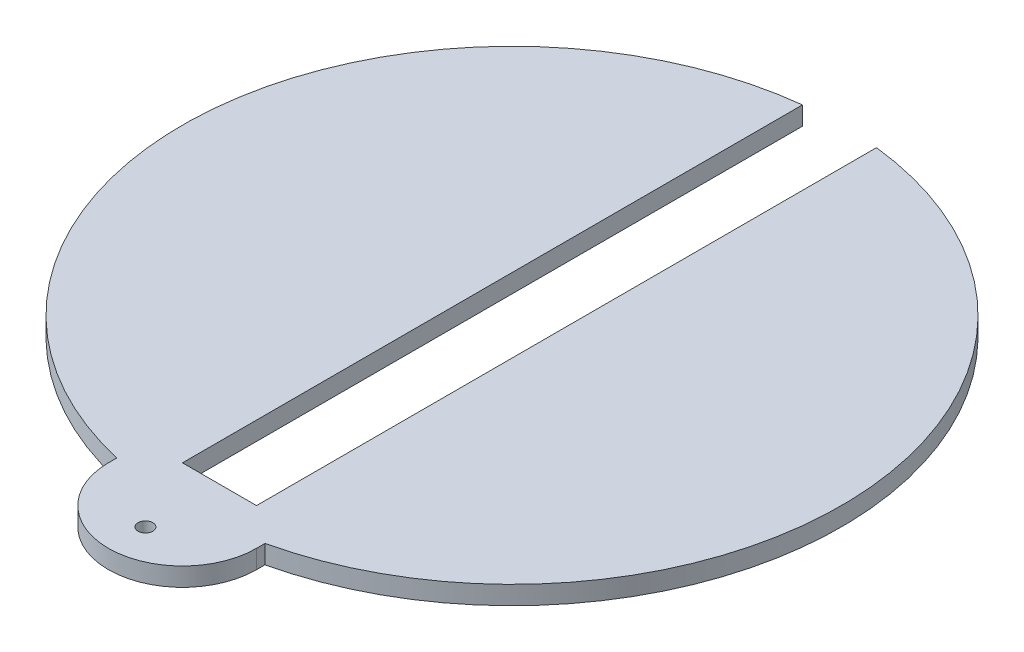
ISO-10303-21;
HEADER;
FILE_DESCRIPTION(('STEP AP214'),'2;1');
FILE_NAME('part.step','',(''),(''),'','','');
FILE_SCHEMA(('AUTOMOTIVE_DESIGN { 1 0 10303 214 1 1 1 1 }'));
ENDSEC;
DATA;
#1=APPLICATION_CONTEXT('core data for automotive mechanical design processes');
#2=APPLICATION_PROTOCOL_DEFINITION('international standard','automotive_design',2000,#1);
#3=PRODUCT_CONTEXT('',#1,'mechanical');
#4=PRODUCT('Part','Part','',(#3));
#5=PRODUCT_RELATED_PRODUCT_CATEGORY('part','',(#4));
#6=PRODUCT_DEFINITION_FORMATION('','',#4);
#7=PRODUCT_DEFINITION_CONTEXT('part definition',#1,'design');
#8=PRODUCT_DEFINITION('design','',#6,#7);
#9=PRODUCT_DEFINITION_SHAPE('','',#8);
#10=(LENGTH_UNIT() NAMED_UNIT(*) SI_UNIT(.MILLI.,.METRE.));
#11=(NAMED_UNIT(*) PLANE_ANGLE_UNIT() SI_UNIT($,.RADIAN.));
#12=(NAMED_UNIT(*) SI_UNIT($,.STERADIAN.) SOLID_ANGLE_UNIT());
#13=UNCERTAINTY_MEASURE_WITH_UNIT(LENGTH_MEASURE(1.E-05),#10,'distance_accuracy_value','');
#14=(GEOMETRIC_REPRESENTATION_CONTEXT(3) GLOBAL_UNCERTAINTY_ASSIGNED_CONTEXT((#13)) GLOBAL_UNIT_ASSIGNED_CONTEXT((#10,
#11,#12)) REPRESENTATION_CONTEXT('',''));
#15=CARTESIAN_POINT('',(0.,0.,0.));
#16=DIRECTION('',(0.,0.,1.));
#17=DIRECTION('',(1.,0.,0.));
#18=AXIS2_PLACEMENT_3D('',#15,#16,#17);
#19=CARTESIAN_POINT('',(0.,3.175,56.515));
#20=DIRECTION('',(0.,1.,0.));
#21=DIRECTION('',(0.,0.,1.));
#22=AXIS2_PLACEMENT_3D('',#19,#20,#21);
#23=PLANE('',#22);
#24=CARTESIAN_POINT('',(0.,3.175,62.865));
#25=DIRECTION('',(0.,1.,0.));
#26=DIRECTION('',(0.,0.,1.));
#27=AXIS2_PLACEMENT_3D('',#24,#25,#26);
#28=CIRCLE('',#27,1.27000000000001);
#29=CARTESIAN_POINT('',(0.,3.175,64.135));
#30=VERTEX_POINT('',#29);
#31=EDGE_CURVE('E170',#30,#30,#28,.T.);
#32=ORIENTED_EDGE('',*,*,#31,.F.);
#33=EDGE_LOOP('',(#32));
#34=FACE_BOUND('',#33,.T.);
#35=DIRECTION('',(0.,0.,-1.));
#36=VECTOR('',#35,1.);
#37=CARTESIAN_POINT('',(-6.35,3.175,50.165));
#38=LINE('',#37,#36);
#39=CARTESIAN_POINT('',(-6.35,3.175,50.165));
#40=VERTEX_POINT('',#39);
#41=CARTESIAN_POINT('',(-6.35,3.175,-56.1571253270678));
#42=VERTEX_POINT('',#41);
#43=EDGE_CURVE('E151',#40,#42,#38,.T.);
#44=ORIENTED_EDGE('',*,*,#43,.T.);
#45=CARTESIAN_POINT('',(0.,3.175,0.));
#46=DIRECTION('',(0.,1.,0.));
#47=DIRECTION('',(0.,0.,1.));
#48=AXIS2_PLACEMENT_3D('',#45,#46,#47);
#49=CIRCLE('',#48,56.515);
#50=CARTESIAN_POINT('',(-12.7,3.175,55.0695489812655));
#51=VERTEX_POINT('',#50);
#52=EDGE_CURVE('E160',#42,#51,#49,.T.);
#53=ORIENTED_EDGE('',*,*,#52,.T.);
#54=DIRECTION('',(0.,0.,1.));
#55=VECTOR('',#54,1.);
#56=CARTESIAN_POINT('',(-12.7,3.175,56.515));
#57=LINE('',#56,#55);
#58=CARTESIAN_POINT('',(-12.7,3.175,56.515));
#59=VERTEX_POINT('',#58);
#60=EDGE_CURVE('E156',#51,#59,#57,.T.);
#61=ORIENTED_EDGE('',*,*,#60,.T.);
#62=CARTESIAN_POINT('',(0.,3.175,56.515));
#63=DIRECTION('',(0.,1.,0.));
#64=DIRECTION('',(0.,0.,1.));
#65=AXIS2_PLACEMENT_3D('',#62,#63,#64);
#66=CIRCLE('',#65,12.7);
#67=CARTESIAN_POINT('',(12.7,3.175,56.515));
#68=VERTEX_POINT('',#67);
#69=EDGE_CURVE('E154',#59,#68,#66,.T.);
#70=ORIENTED_EDGE('',*,*,#69,.T.);
#71=DIRECTION('',(0.,0.,1.));
#72=VECTOR('',#71,1.);
#73=CARTESIAN_POINT('',(12.7,3.175,56.515));
#74=LINE('',#73,#72);
#75=CARTESIAN_POINT('',(12.7,3.175,55.0695489812655));
#76=VERTEX_POINT('',#75);
#77=EDGE_CURVE('E47',#68,#76,#74,.F.);
#78=ORIENTED_EDGE('',*,*,#77,.T.);
#79=CARTESIAN_POINT('',(0.,3.175,0.));
#80=DIRECTION('',(0.,1.,0.));
#81=DIRECTION('',(0.,0.,1.));
#82=AXIS2_PLACEMENT_3D('',#79,#80,#81);
#83=CIRCLE('',#82,56.515);
#84=CARTESIAN_POINT('',(6.35,3.175,-56.1571253270678));
#85=VERTEX_POINT('',#84);
#86=EDGE_CURVE('E91',#76,#85,#83,.T.);
#87=ORIENTED_EDGE('',*,*,#86,.T.);
#88=DIRECTION('',(0.,0.,-1.));
#89=VECTOR('',#88,1.);
#90=CARTESIAN_POINT('',(6.35,3.175,50.165));
#91=LINE('',#90,#89);
#92=CARTESIAN_POINT('',(6.35,3.175,50.165));
#93=VERTEX_POINT('',#92);
#94=EDGE_CURVE('E164',#93,#85,#91,.T.);
#95=ORIENTED_EDGE('',*,*,#94,.F.);
#96=DIRECTION('',(1.,0.,0.));
#97=VECTOR('',#96,1.);
#98=CARTESIAN_POINT('',(-6.35,3.175,50.165));
#99=LINE('',#98,#97);
#100=EDGE_CURVE('E126',#40,#93,#99,.T.);
#101=ORIENTED_EDGE('',*,*,#100,.F.);
#102=EDGE_LOOP('',(#44,#53,#61,#70,#78,#87,#95,#101));
#103=FACE_BOUND('',#102,.T.);
#104=ADVANCED_FACE('F43',(#34,#103),#23,.T.);
#105=CARTESIAN_POINT('',(0.,0.,56.515));
#106=DIRECTION('',(0.,1.,0.));
#107=DIRECTION('',(0.,0.,1.));
#108=AXIS2_PLACEMENT_3D('',#105,#106,#107);
#109=PLANE('',#108);
#110=CARTESIAN_POINT('',(0.,0.,62.865));
#111=DIRECTION('',(0.,1.,0.));
#112=DIRECTION('',(0.,0.,1.));
#113=AXIS2_PLACEMENT_3D('',#110,#111,#112);
#114=CIRCLE('',#113,1.27000000000001);
#115=CARTESIAN_POINT('',(0.,0.,64.135));
#116=VERTEX_POINT('',#115);
#117=EDGE_CURVE('E145',#116,#116,#114,.T.);
#118=ORIENTED_EDGE('',*,*,#117,.T.);
#119=EDGE_LOOP('',(#118));
#120=FACE_BOUND('',#119,.T.);
#121=CARTESIAN_POINT('',(0.,0.,0.));
#122=DIRECTION('',(0.,1.,0.));
#123=DIRECTION('',(0.,0.,1.));
#124=AXIS2_PLACEMENT_3D('',#121,#122,#123);
#125=CIRCLE('',#124,56.515);
#126=CARTESIAN_POINT('',(-6.35,0.,-56.1571253270678));
#127=VERTEX_POINT('',#126);
#128=CARTESIAN_POINT('',(-12.7,0.,55.0695489812655));
#129=VERTEX_POINT('',#128);
#130=EDGE_CURVE('E207',#127,#129,#125,.T.);
#131=ORIENTED_EDGE('',*,*,#130,.F.);
#132=DIRECTION('',(0.,0.,-1.));
#133=VECTOR('',#132,1.);
#134=CARTESIAN_POINT('',(-6.35,0.,50.165));
#135=LINE('',#134,#133);
#136=CARTESIAN_POINT('',(-6.35,0.,50.165));
#137=VERTEX_POINT('',#136);
#138=EDGE_CURVE('E141',#137,#127,#135,.T.);
#139=ORIENTED_EDGE('',*,*,#138,.F.);
#140=DIRECTION('',(1.,0.,0.));
#141=VECTOR('',#140,1.);
#142=CARTESIAN_POINT('',(-6.35,0.,50.165));
#143=LINE('',#142,#141);
#144=CARTESIAN_POINT('',(6.35,0.,50.165));
#145=VERTEX_POINT('',#144);
#146=EDGE_CURVE('E124',#137,#145,#143,.T.);
#147=ORIENTED_EDGE('',*,*,#146,.T.);
#148=DIRECTION('',(0.,0.,-1.));
#149=VECTOR('',#148,1.);
#150=CARTESIAN_POINT('',(6.35,0.,50.165));
#151=LINE('',#150,#149);
#152=CARTESIAN_POINT('',(6.35,0.,-56.1571253270678));
#153=VERTEX_POINT('',#152);
#154=EDGE_CURVE('E133',#145,#153,#151,.T.);
#155=ORIENTED_EDGE('',*,*,#154,.T.);
#156=CARTESIAN_POINT('',(0.,0.,0.));
#157=DIRECTION('',(0.,1.,0.));
#158=DIRECTION('',(0.,0.,1.));
#159=AXIS2_PLACEMENT_3D('',#156,#157,#158);
#160=CIRCLE('',#159,56.515);
#161=CARTESIAN_POINT('',(12.7,0.,55.0695489812655));
#162=VERTEX_POINT('',#161);
#163=EDGE_CURVE('E100',#162,#153,#160,.T.);
#164=ORIENTED_EDGE('',*,*,#163,.F.);
#165=DIRECTION('',(0.,0.,-1.));
#166=VECTOR('',#165,1.);
#167=CARTESIAN_POINT('',(12.7,0.,0.));
#168=LINE('',#167,#166);
#169=CARTESIAN_POINT('',(12.7,0.,56.515));
#170=VERTEX_POINT('',#169);
#171=EDGE_CURVE('E202',#170,#162,#168,.T.);
#172=ORIENTED_EDGE('',*,*,#171,.F.);
#173=CARTESIAN_POINT('',(0.,0.,56.515));
#174=DIRECTION('',(0.,1.,0.));
#175=DIRECTION('',(0.,0.,1.));
#176=AXIS2_PLACEMENT_3D('',#173,#174,#175);
#177=CIRCLE('',#176,12.7);
#178=CARTESIAN_POINT('',(-12.7,0.,56.515));
#179=VERTEX_POINT('',#178);
#180=EDGE_CURVE('E137',#179,#170,#177,.T.);
#181=ORIENTED_EDGE('',*,*,#180,.F.);
#182=DIRECTION('',(0.,0.,1.));
#183=VECTOR('',#182,1.);
#184=CARTESIAN_POINT('',(-12.7,0.,0.));
#185=LINE('',#184,#183);
#186=EDGE_CURVE('E210',#129,#179,#185,.T.);
#187=ORIENTED_EDGE('',*,*,#186,.F.);
#188=EDGE_LOOP('',(#131,#139,#147,#155,#164,#172,#181,#187));
#189=FACE_BOUND('',#188,.T.);
#190=ADVANCED_FACE('F140',(#120,#189),#109,.F.);
#191=CARTESIAN_POINT('',(-6.35,3.175,50.165));
#192=DIRECTION('',(-1.,0.,0.));
#193=DIRECTION('',(0.,0.,1.));
#194=AXIS2_PLACEMENT_3D('',#191,#192,#193);
#195=PLANE('',#194);
#196=DIRECTION('',(0.,1.,0.));
#197=VECTOR('',#196,1.);
#198=CARTESIAN_POINT('',(-6.35,0.,-56.1571253270678));
#199=LINE('',#198,#197);
#200=EDGE_CURVE('E193',#127,#42,#199,.T.);
#201=ORIENTED_EDGE('',*,*,#200,.T.);
#202=ORIENTED_EDGE('',*,*,#43,.F.);
#203=DIRECTION('',(0.,-1.,0.));
#204=VECTOR('',#203,1.);
#205=CARTESIAN_POINT('',(-6.35,3.175,50.165));
#206=LINE('',#205,#204);
#207=EDGE_CURVE('E114',#40,#137,#206,.T.);
#208=ORIENTED_EDGE('',*,*,#207,.T.);
#209=ORIENTED_EDGE('',*,*,#138,.T.);
#210=EDGE_LOOP('',(#201,#202,#208,#209));
#211=FACE_BOUND('',#210,.T.);
#212=ADVANCED_FACE('F45',(#211),#195,.F.);
#213=CARTESIAN_POINT('',(6.35,3.175,50.165));
#214=DIRECTION('',(-1.,0.,0.));
#215=DIRECTION('',(0.,0.,1.));
#216=AXIS2_PLACEMENT_3D('',#213,#214,#215);
#217=PLANE('',#216);
#218=ORIENTED_EDGE('',*,*,#94,.T.);
#219=DIRECTION('',(0.,1.,0.));
#220=VECTOR('',#219,1.);
#221=CARTESIAN_POINT('',(6.35,0.,-56.1571253270678));
#222=LINE('',#221,#220);
#223=EDGE_CURVE('E135',#153,#85,#222,.T.);
#224=ORIENTED_EDGE('',*,*,#223,.F.);
#225=ORIENTED_EDGE('',*,*,#154,.F.);
#226=DIRECTION('',(0.,-1.,0.));
#227=VECTOR('',#226,1.);
#228=CARTESIAN_POINT('',(6.35,3.175,50.165));
#229=LINE('',#228,#227);
#230=EDGE_CURVE('E120',#93,#145,#229,.T.);
#231=ORIENTED_EDGE('',*,*,#230,.F.);
#232=EDGE_LOOP('',(#218,#224,#225,#231));
#233=FACE_BOUND('',#232,.T.);
#234=ADVANCED_FACE('F134',(#233),#217,.T.);
#235=CARTESIAN_POINT('',(0.,3.175,56.515));
#236=DIRECTION('',(0.,-1.,0.));
#237=DIRECTION('',(0.,0.,-1.));
#238=AXIS2_PLACEMENT_3D('',#235,#236,#237);
#239=CYLINDRICAL_SURFACE('',#238,12.7);
#240=ORIENTED_EDGE('',*,*,#180,.T.);
#241=DIRECTION('',(0.,-1.,0.));
#242=VECTOR('',#241,1.);
#243=CARTESIAN_POINT('',(12.7,3.175,56.515));
#244=LINE('',#243,#242);
#245=EDGE_CURVE('E54',#68,#170,#244,.T.);
#246=ORIENTED_EDGE('',*,*,#245,.F.);
#247=ORIENTED_EDGE('',*,*,#69,.F.);
#248=DIRECTION('',(0.,-1.,0.));
#249=VECTOR('',#248,1.);
#250=CARTESIAN_POINT('',(-12.7,3.175,56.515));
#251=LINE('',#250,#249);
#252=EDGE_CURVE('E11',#59,#179,#251,.T.);
#253=ORIENTED_EDGE('',*,*,#252,.T.);
#254=EDGE_LOOP('',(#240,#246,#247,#253));
#255=FACE_BOUND('',#254,.T.);
#256=ADVANCED_FACE('F220',(#255),#239,.T.);
#257=CARTESIAN_POINT('',(-6.35,3.175,50.165));
#258=DIRECTION('',(0.,0.,-1.));
#259=DIRECTION('',(-1.,0.,0.));
#260=AXIS2_PLACEMENT_3D('',#257,#258,#259);
#261=PLANE('',#260);
#262=ORIENTED_EDGE('',*,*,#146,.F.);
#263=ORIENTED_EDGE('',*,*,#207,.F.);
#264=ORIENTED_EDGE('',*,*,#100,.T.);
#265=ORIENTED_EDGE('',*,*,#230,.T.);
#266=EDGE_LOOP('',(#262,#263,#264,#265));
#267=FACE_BOUND('',#266,.T.);
#268=ADVANCED_FACE('F122',(#267),#261,.T.);
#269=CARTESIAN_POINT('',(0.,0.,62.865));
#270=DIRECTION('',(0.,1.,0.));
#271=DIRECTION('',(0.,0.,1.));
#272=AXIS2_PLACEMENT_3D('',#269,#270,#271);
#273=CYLINDRICAL_SURFACE('',#272,1.27000000000001);
#274=ORIENTED_EDGE('',*,*,#117,.F.);
#275=EDGE_LOOP('',(#274));
#276=FACE_BOUND('',#275,.T.);
#277=ORIENTED_EDGE('',*,*,#31,.T.);
#278=EDGE_LOOP('',(#277));
#279=FACE_BOUND('',#278,.T.);
#280=ADVANCED_FACE('F238',(#276,#279),#273,.F.);
#281=CARTESIAN_POINT('',(0.,0.,0.));
#282=DIRECTION('',(0.,1.,0.));
#283=DIRECTION('',(0.,0.,1.));
#284=AXIS2_PLACEMENT_3D('',#281,#282,#283);
#285=CYLINDRICAL_SURFACE('',#284,56.515);
#286=ORIENTED_EDGE('',*,*,#86,.F.);
#287=DIRECTION('',(0.,1.,0.));
#288=VECTOR('',#287,1.);
#289=CARTESIAN_POINT('',(12.7,0.,55.0695489812655));
#290=LINE('',#289,#288);
#291=EDGE_CURVE('E198',#162,#76,#290,.T.);
#292=ORIENTED_EDGE('',*,*,#291,.F.);
#293=ORIENTED_EDGE('',*,*,#163,.T.);
#294=ORIENTED_EDGE('',*,*,#223,.T.);
#295=EDGE_LOOP('',(#286,#292,#293,#294));
#296=FACE_BOUND('',#295,.T.);
#297=ADVANCED_FACE('F215',(#296),#285,.T.);
#298=CARTESIAN_POINT('',(0.,0.,0.));
#299=DIRECTION('',(0.,1.,0.));
#300=DIRECTION('',(0.,0.,1.));
#301=AXIS2_PLACEMENT_3D('',#298,#299,#300);
#302=CYLINDRICAL_SURFACE('',#301,56.515);
#303=ORIENTED_EDGE('',*,*,#52,.F.);
#304=ORIENTED_EDGE('',*,*,#200,.F.);
#305=ORIENTED_EDGE('',*,*,#130,.T.);
#306=DIRECTION('',(0.,1.,0.));
#307=VECTOR('',#306,1.);
#308=CARTESIAN_POINT('',(-12.7,0.,55.0695489812655));
#309=LINE('',#308,#307);
#310=EDGE_CURVE('E63',#129,#51,#309,.T.);
#311=ORIENTED_EDGE('',*,*,#310,.T.);
#312=EDGE_LOOP('',(#303,#304,#305,#311));
#313=FACE_BOUND('',#312,.T.);
#314=ADVANCED_FACE('F223',(#313),#302,.T.);
#315=CARTESIAN_POINT('',(-12.7,0.,0.));
#316=DIRECTION('',(-1.,0.,0.));
#317=DIRECTION('',(0.,0.,1.));
#318=AXIS2_PLACEMENT_3D('',#315,#316,#317);
#319=PLANE('',#318);
#320=ORIENTED_EDGE('',*,*,#310,.F.);
#321=ORIENTED_EDGE('',*,*,#186,.T.);
#322=ORIENTED_EDGE('',*,*,#252,.F.);
#323=ORIENTED_EDGE('',*,*,#60,.F.);
#324=EDGE_LOOP('',(#320,#321,#322,#323));
#325=FACE_BOUND('',#324,.T.);
#326=ADVANCED_FACE('F221',(#325),#319,.T.);
#327=CARTESIAN_POINT('',(12.7,0.,0.));
#328=DIRECTION('',(1.,0.,0.));
#329=DIRECTION('',(0.,0.,-1.));
#330=AXIS2_PLACEMENT_3D('',#327,#328,#329);
#331=PLANE('',#330);
#332=ORIENTED_EDGE('',*,*,#245,.T.);
#333=ORIENTED_EDGE('',*,*,#171,.T.);
#334=ORIENTED_EDGE('',*,*,#291,.T.);
#335=ORIENTED_EDGE('',*,*,#77,.F.);
#336=EDGE_LOOP('',(#332,#333,#334,#335));
#337=FACE_BOUND('',#336,.T.);
#338=ADVANCED_FACE('F216',(#337),#331,.T.);
#339=CLOSED_SHELL('',(#104,#190,#212,#234,#256,#268,#280,#297,#314,#326,#338));
#340=MANIFOLD_SOLID_BREP('B2',#339);
#341=ADVANCED_BREP_SHAPE_REPRESENTATION('',(#18,#340),#14);
#342=SHAPE_DEFINITION_REPRESENTATION(#9,#341);
ENDSEC;
END-ISO-10303-21;
